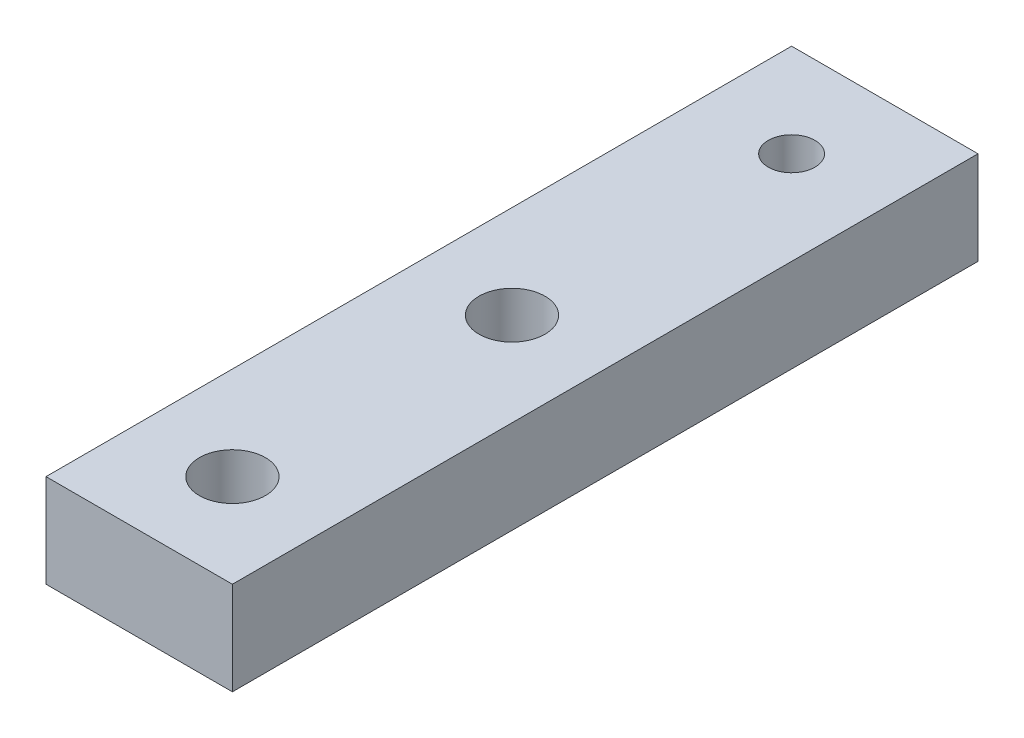
ISO-10303-21;
HEADER;
FILE_DESCRIPTION(('STEP AP214'),'2;1');
FILE_NAME('part.step','',(''),(''),'','','');
FILE_SCHEMA(('AUTOMOTIVE_DESIGN { 1 0 10303 214 1 1 1 1 }'));
ENDSEC;
DATA;
#1=APPLICATION_CONTEXT('core data for automotive mechanical design processes');
#2=APPLICATION_PROTOCOL_DEFINITION('international standard','automotive_design',2000,#1);
#3=PRODUCT_CONTEXT('',#1,'mechanical');
#4=PRODUCT('Part','Part','',(#3));
#5=PRODUCT_RELATED_PRODUCT_CATEGORY('part','',(#4));
#6=PRODUCT_DEFINITION_FORMATION('','',#4);
#7=PRODUCT_DEFINITION_CONTEXT('part definition',#1,'design');
#8=PRODUCT_DEFINITION('design','',#6,#7);
#9=PRODUCT_DEFINITION_SHAPE('','',#8);
#10=(LENGTH_UNIT() NAMED_UNIT(*) SI_UNIT(.MILLI.,.METRE.));
#11=(NAMED_UNIT(*) PLANE_ANGLE_UNIT() SI_UNIT($,.RADIAN.));
#12=(NAMED_UNIT(*) SI_UNIT($,.STERADIAN.) SOLID_ANGLE_UNIT());
#13=UNCERTAINTY_MEASURE_WITH_UNIT(LENGTH_MEASURE(1.E-05),#10,'distance_accuracy_value','');
#14=(GEOMETRIC_REPRESENTATION_CONTEXT(3) GLOBAL_UNCERTAINTY_ASSIGNED_CONTEXT((#13)) GLOBAL_UNIT_ASSIGNED_CONTEXT((#10,
#11,#12)) REPRESENTATION_CONTEXT('',''));
#15=CARTESIAN_POINT('',(0.,0.,0.));
#16=DIRECTION('',(0.,0.,1.));
#17=DIRECTION('',(1.,0.,0.));
#18=AXIS2_PLACEMENT_3D('',#15,#16,#17);
#19=CARTESIAN_POINT('',(0.,6.35,0.));
#20=DIRECTION('',(1.,0.,0.));
#21=DIRECTION('',(0.,0.,-1.));
#22=AXIS2_PLACEMENT_3D('',#19,#20,#21);
#23=PLANE('',#22);
#24=DIRECTION('',(0.,0.,1.));
#25=VECTOR('',#24,1.);
#26=CARTESIAN_POINT('',(0.,0.,0.));
#27=LINE('',#26,#25);
#28=CARTESIAN_POINT('',(0.,0.,-50.8));
#29=VERTEX_POINT('',#28);
#30=CARTESIAN_POINT('',(0.,0.,0.));
#31=VERTEX_POINT('',#30);
#32=EDGE_CURVE('E95',#29,#31,#27,.T.);
#33=ORIENTED_EDGE('',*,*,#32,.T.);
#34=DIRECTION('',(0.,-1.,0.));
#35=VECTOR('',#34,1.);
#36=CARTESIAN_POINT('',(0.,6.35,0.));
#37=LINE('',#36,#35);
#38=CARTESIAN_POINT('',(0.,6.35,0.));
#39=VERTEX_POINT('',#38);
#40=EDGE_CURVE('E11',#39,#31,#37,.T.);
#41=ORIENTED_EDGE('',*,*,#40,.F.);
#42=DIRECTION('',(0.,0.,1.));
#43=VECTOR('',#42,1.);
#44=CARTESIAN_POINT('',(0.,6.35,0.));
#45=LINE('',#44,#43);
#46=CARTESIAN_POINT('',(0.,6.35,-50.8));
#47=VERTEX_POINT('',#46);
#48=EDGE_CURVE('E83',#47,#39,#45,.T.);
#49=ORIENTED_EDGE('',*,*,#48,.F.);
#50=DIRECTION('',(0.,-1.,0.));
#51=VECTOR('',#50,1.);
#52=CARTESIAN_POINT('',(0.,6.35,-50.8));
#53=LINE('',#52,#51);
#54=EDGE_CURVE('E91',#47,#29,#53,.T.);
#55=ORIENTED_EDGE('',*,*,#54,.T.);
#56=EDGE_LOOP('',(#33,#41,#49,#55));
#57=FACE_BOUND('',#56,.T.);
#58=ADVANCED_FACE('F32',(#57),#23,.F.);
#59=CARTESIAN_POINT('',(0.,6.35,0.));
#60=DIRECTION('',(0.,0.,-1.));
#61=DIRECTION('',(-1.,0.,0.));
#62=AXIS2_PLACEMENT_3D('',#59,#60,#61);
#63=PLANE('',#62);
#64=DIRECTION('',(1.,0.,0.));
#65=VECTOR('',#64,1.);
#66=CARTESIAN_POINT('',(0.,0.,0.));
#67=LINE('',#66,#65);
#68=CARTESIAN_POINT('',(12.7,0.,0.));
#69=VERTEX_POINT('',#68);
#70=EDGE_CURVE('E87',#31,#69,#67,.T.);
#71=ORIENTED_EDGE('',*,*,#70,.T.);
#72=DIRECTION('',(0.,-1.,0.));
#73=VECTOR('',#72,1.);
#74=CARTESIAN_POINT('',(12.7,6.35,0.));
#75=LINE('',#74,#73);
#76=CARTESIAN_POINT('',(12.7,6.35,0.));
#77=VERTEX_POINT('',#76);
#78=EDGE_CURVE('E40',#77,#69,#75,.T.);
#79=ORIENTED_EDGE('',*,*,#78,.F.);
#80=DIRECTION('',(1.,0.,0.));
#81=VECTOR('',#80,1.);
#82=CARTESIAN_POINT('',(0.,6.35,0.));
#83=LINE('',#82,#81);
#84=EDGE_CURVE('E78',#39,#77,#83,.T.);
#85=ORIENTED_EDGE('',*,*,#84,.F.);
#86=ORIENTED_EDGE('',*,*,#40,.T.);
#87=EDGE_LOOP('',(#71,#79,#85,#86));
#88=FACE_BOUND('',#87,.T.);
#89=ADVANCED_FACE('F86',(#88),#63,.F.);
#90=CARTESIAN_POINT('',(12.7,6.35,0.));
#91=DIRECTION('',(-1.,0.,0.));
#92=DIRECTION('',(0.,0.,1.));
#93=AXIS2_PLACEMENT_3D('',#90,#91,#92);
#94=PLANE('',#93);
#95=DIRECTION('',(0.,0.,-1.));
#96=VECTOR('',#95,1.);
#97=CARTESIAN_POINT('',(12.7,0.,0.));
#98=LINE('',#97,#96);
#99=CARTESIAN_POINT('',(12.7,0.,-50.8));
#100=VERTEX_POINT('',#99);
#101=EDGE_CURVE('E65',#69,#100,#98,.T.);
#102=ORIENTED_EDGE('',*,*,#101,.T.);
#103=DIRECTION('',(0.,-1.,0.));
#104=VECTOR('',#103,1.);
#105=CARTESIAN_POINT('',(12.7,6.35,-50.8));
#106=LINE('',#105,#104);
#107=CARTESIAN_POINT('',(12.7,6.35,-50.8));
#108=VERTEX_POINT('',#107);
#109=EDGE_CURVE('E88',#108,#100,#106,.T.);
#110=ORIENTED_EDGE('',*,*,#109,.F.);
#111=DIRECTION('',(0.,0.,-1.));
#112=VECTOR('',#111,1.);
#113=CARTESIAN_POINT('',(12.7,6.35,0.));
#114=LINE('',#113,#112);
#115=EDGE_CURVE('E81',#77,#108,#114,.T.);
#116=ORIENTED_EDGE('',*,*,#115,.F.);
#117=ORIENTED_EDGE('',*,*,#78,.T.);
#118=EDGE_LOOP('',(#102,#110,#116,#117));
#119=FACE_BOUND('',#118,.T.);
#120=ADVANCED_FACE('F89',(#119),#94,.F.);
#121=CARTESIAN_POINT('',(0.,6.35,-50.8));
#122=DIRECTION('',(0.,0.,1.));
#123=DIRECTION('',(1.,0.,0.));
#124=AXIS2_PLACEMENT_3D('',#121,#122,#123);
#125=PLANE('',#124);
#126=DIRECTION('',(-1.,0.,0.));
#127=VECTOR('',#126,1.);
#128=CARTESIAN_POINT('',(0.,0.,-50.8));
#129=LINE('',#128,#127);
#130=EDGE_CURVE('E71',#100,#29,#129,.T.);
#131=ORIENTED_EDGE('',*,*,#130,.T.);
#132=ORIENTED_EDGE('',*,*,#54,.F.);
#133=DIRECTION('',(-1.,0.,0.));
#134=VECTOR('',#133,1.);
#135=CARTESIAN_POINT('',(0.,6.35,-50.8));
#136=LINE('',#135,#134);
#137=EDGE_CURVE('E48',#108,#47,#136,.T.);
#138=ORIENTED_EDGE('',*,*,#137,.F.);
#139=ORIENTED_EDGE('',*,*,#109,.T.);
#140=EDGE_LOOP('',(#131,#132,#138,#139));
#141=FACE_BOUND('',#140,.T.);
#142=ADVANCED_FACE('F103',(#141),#125,.F.);
#143=CARTESIAN_POINT('',(0.,6.35,0.));
#144=DIRECTION('',(0.,-1.,0.));
#145=DIRECTION('',(0.,0.,-1.));
#146=AXIS2_PLACEMENT_3D('',#143,#144,#145);
#147=PLANE('',#146);
#148=CARTESIAN_POINT('',(6.35,6.35,-25.4));
#149=DIRECTION('',(0.,1.,0.));
#150=DIRECTION('',(0.,0.,1.));
#151=AXIS2_PLACEMENT_3D('',#148,#149,#150);
#152=CIRCLE('',#151,2.2479);
#153=CARTESIAN_POINT('',(6.35,6.35,-23.1521));
#154=VERTEX_POINT('',#153);
#155=EDGE_CURVE('E123',#154,#154,#152,.T.);
#156=ORIENTED_EDGE('',*,*,#155,.F.);
#157=EDGE_LOOP('',(#156));
#158=FACE_BOUND('',#157,.T.);
#159=CARTESIAN_POINT('',(6.35,6.35,-6.35));
#160=DIRECTION('',(0.,1.,0.));
#161=DIRECTION('',(0.,0.,1.));
#162=AXIS2_PLACEMENT_3D('',#159,#160,#161);
#163=CIRCLE('',#162,2.2479);
#164=CARTESIAN_POINT('',(6.35,6.35,-4.1021));
#165=VERTEX_POINT('',#164);
#166=EDGE_CURVE('E117',#165,#165,#163,.T.);
#167=ORIENTED_EDGE('',*,*,#166,.F.);
#168=EDGE_LOOP('',(#167));
#169=FACE_BOUND('',#168,.T.);
#170=CARTESIAN_POINT('',(6.34999999999999,6.35,-44.45));
#171=DIRECTION('',(0.,1.,0.));
#172=DIRECTION('',(0.,0.,1.));
#173=AXIS2_PLACEMENT_3D('',#170,#171,#172);
#174=CIRCLE('',#173,1.5875);
#175=CARTESIAN_POINT('',(6.34999999999999,6.35,-42.8625));
#176=VERTEX_POINT('',#175);
#177=EDGE_CURVE('E109',#176,#176,#174,.T.);
#178=ORIENTED_EDGE('',*,*,#177,.F.);
#179=EDGE_LOOP('',(#178));
#180=FACE_BOUND('',#179,.T.);
#181=ORIENTED_EDGE('',*,*,#48,.T.);
#182=ORIENTED_EDGE('',*,*,#84,.T.);
#183=ORIENTED_EDGE('',*,*,#115,.T.);
#184=ORIENTED_EDGE('',*,*,#137,.T.);
#185=EDGE_LOOP('',(#181,#182,#183,#184));
#186=FACE_BOUND('',#185,.T.);
#187=ADVANCED_FACE('F79',(#158,#169,#180,#186),#147,.F.);
#188=CARTESIAN_POINT('',(0.,0.,0.));
#189=DIRECTION('',(0.,-1.,0.));
#190=DIRECTION('',(0.,0.,-1.));
#191=AXIS2_PLACEMENT_3D('',#188,#189,#190);
#192=PLANE('',#191);
#193=CARTESIAN_POINT('',(6.35,0.,-25.4));
#194=DIRECTION('',(0.,1.,0.));
#195=DIRECTION('',(0.,0.,1.));
#196=AXIS2_PLACEMENT_3D('',#193,#194,#195);
#197=CIRCLE('',#196,2.2479);
#198=CARTESIAN_POINT('',(6.35,0.,-23.1521));
#199=VERTEX_POINT('',#198);
#200=EDGE_CURVE('E120',#199,#199,#197,.T.);
#201=ORIENTED_EDGE('',*,*,#200,.T.);
#202=EDGE_LOOP('',(#201));
#203=FACE_BOUND('',#202,.T.);
#204=CARTESIAN_POINT('',(6.35,0.,-6.35));
#205=DIRECTION('',(0.,1.,0.));
#206=DIRECTION('',(0.,0.,1.));
#207=AXIS2_PLACEMENT_3D('',#204,#205,#206);
#208=CIRCLE('',#207,2.2479);
#209=CARTESIAN_POINT('',(6.35,0.,-4.1021));
#210=VERTEX_POINT('',#209);
#211=EDGE_CURVE('E112',#210,#210,#208,.T.);
#212=ORIENTED_EDGE('',*,*,#211,.T.);
#213=EDGE_LOOP('',(#212));
#214=FACE_BOUND('',#213,.T.);
#215=CARTESIAN_POINT('',(6.34999999999999,0.,-44.45));
#216=DIRECTION('',(0.,1.,0.));
#217=DIRECTION('',(0.,0.,1.));
#218=AXIS2_PLACEMENT_3D('',#215,#216,#217);
#219=CIRCLE('',#218,1.5875);
#220=CARTESIAN_POINT('',(6.34999999999999,0.,-42.8625));
#221=VERTEX_POINT('',#220);
#222=EDGE_CURVE('E98',#221,#221,#219,.T.);
#223=ORIENTED_EDGE('',*,*,#222,.T.);
#224=EDGE_LOOP('',(#223));
#225=FACE_BOUND('',#224,.T.);
#226=ORIENTED_EDGE('',*,*,#32,.F.);
#227=ORIENTED_EDGE('',*,*,#130,.F.);
#228=ORIENTED_EDGE('',*,*,#101,.F.);
#229=ORIENTED_EDGE('',*,*,#70,.F.);
#230=EDGE_LOOP('',(#226,#227,#228,#229));
#231=FACE_BOUND('',#230,.T.);
#232=ADVANCED_FACE('F106',(#203,#214,#225,#231),#192,.T.);
#233=CARTESIAN_POINT('',(6.34999999999999,0.,-44.45));
#234=DIRECTION('',(0.,1.,0.));
#235=DIRECTION('',(0.,0.,1.));
#236=AXIS2_PLACEMENT_3D('',#233,#234,#235);
#237=CYLINDRICAL_SURFACE('',#236,1.5875);
#238=ORIENTED_EDGE('',*,*,#222,.F.);
#239=EDGE_LOOP('',(#238));
#240=FACE_BOUND('',#239,.T.);
#241=ORIENTED_EDGE('',*,*,#177,.T.);
#242=EDGE_LOOP('',(#241));
#243=FACE_BOUND('',#242,.T.);
#244=ADVANCED_FACE('F136',(#240,#243),#237,.F.);
#245=CARTESIAN_POINT('',(6.35,6.35,-6.35));
#246=DIRECTION('',(0.,1.,0.));
#247=DIRECTION('',(0.,0.,1.));
#248=AXIS2_PLACEMENT_3D('',#245,#246,#247);
#249=CYLINDRICAL_SURFACE('',#248,2.2479);
#250=ORIENTED_EDGE('',*,*,#211,.F.);
#251=EDGE_LOOP('',(#250));
#252=FACE_BOUND('',#251,.T.);
#253=ORIENTED_EDGE('',*,*,#166,.T.);
#254=EDGE_LOOP('',(#253));
#255=FACE_BOUND('',#254,.T.);
#256=ADVANCED_FACE('F138',(#252,#255),#249,.F.);
#257=CARTESIAN_POINT('',(6.35,6.35,-25.4));
#258=DIRECTION('',(0.,1.,0.));
#259=DIRECTION('',(0.,0.,1.));
#260=AXIS2_PLACEMENT_3D('',#257,#258,#259);
#261=CYLINDRICAL_SURFACE('',#260,2.2479);
#262=ORIENTED_EDGE('',*,*,#200,.F.);
#263=EDGE_LOOP('',(#262));
#264=FACE_BOUND('',#263,.T.);
#265=ORIENTED_EDGE('',*,*,#155,.T.);
#266=EDGE_LOOP('',(#265));
#267=FACE_BOUND('',#266,.T.);
#268=ADVANCED_FACE('F127',(#264,#267),#261,.F.);
#269=CLOSED_SHELL('',(#58,#89,#120,#142,#187,#232,#244,#256,#268));
#270=MANIFOLD_SOLID_BREP('B2',#269);
#271=ADVANCED_BREP_SHAPE_REPRESENTATION('',(#18,#270),#14);
#272=SHAPE_DEFINITION_REPRESENTATION(#9,#271);
ENDSEC;
END-ISO-10303-21;
